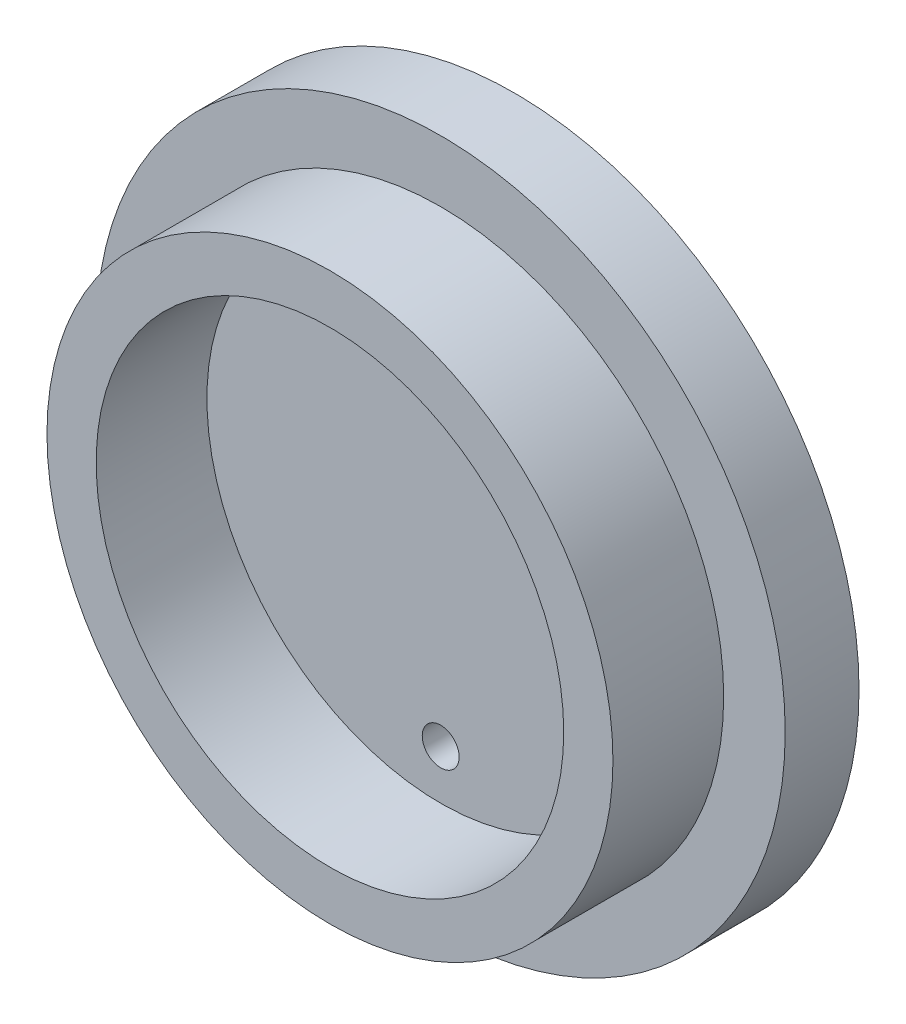
ISO-10303-21;
HEADER;
FILE_DESCRIPTION(('STEP AP214'),'2;1');
FILE_NAME('part.step','',(''),(''),'','','');
FILE_SCHEMA(('AUTOMOTIVE_DESIGN { 1 0 10303 214 1 1 1 1 }'));
ENDSEC;
DATA;
#1=APPLICATION_CONTEXT('core data for automotive mechanical design processes');
#2=APPLICATION_PROTOCOL_DEFINITION('international standard','automotive_design',2000,#1);
#3=PRODUCT_CONTEXT('',#1,'mechanical');
#4=PRODUCT('Part','Part','',(#3));
#5=PRODUCT_RELATED_PRODUCT_CATEGORY('part','',(#4));
#6=PRODUCT_DEFINITION_FORMATION('','',#4);
#7=PRODUCT_DEFINITION_CONTEXT('part definition',#1,'design');
#8=PRODUCT_DEFINITION('design','',#6,#7);
#9=PRODUCT_DEFINITION_SHAPE('','',#8);
#10=(LENGTH_UNIT() NAMED_UNIT(*) SI_UNIT(.MILLI.,.METRE.));
#11=(NAMED_UNIT(*) PLANE_ANGLE_UNIT() SI_UNIT($,.RADIAN.));
#12=(NAMED_UNIT(*) SI_UNIT($,.STERADIAN.) SOLID_ANGLE_UNIT());
#13=UNCERTAINTY_MEASURE_WITH_UNIT(LENGTH_MEASURE(1.E-05),#10,'distance_accuracy_value','');
#14=(GEOMETRIC_REPRESENTATION_CONTEXT(3) GLOBAL_UNCERTAINTY_ASSIGNED_CONTEXT((#13)) GLOBAL_UNIT_ASSIGNED_CONTEXT((#10,
#11,#12)) REPRESENTATION_CONTEXT('',''));
#15=CARTESIAN_POINT('',(0.,0.,0.));
#16=DIRECTION('',(0.,0.,1.));
#17=DIRECTION('',(1.,0.,0.));
#18=AXIS2_PLACEMENT_3D('',#15,#16,#17);
#19=CARTESIAN_POINT('',(0.,0.,6.));
#20=DIRECTION('',(0.,0.,-1.));
#21=DIRECTION('',(-1.,0.,0.));
#22=AXIS2_PLACEMENT_3D('',#19,#20,#21);
#23=CYLINDRICAL_SURFACE('',#22,28.);
#24=CARTESIAN_POINT('',(0.,0.,6.));
#25=DIRECTION('',(0.,0.,1.));
#26=DIRECTION('',(1.,0.,0.));
#27=AXIS2_PLACEMENT_3D('',#24,#25,#26);
#28=CIRCLE('',#27,28.);
#29=CARTESIAN_POINT('',(28.,0.,6.));
#30=VERTEX_POINT('',#29);
#31=EDGE_CURVE('E40',#30,#30,#28,.T.);
#32=ORIENTED_EDGE('',*,*,#31,.F.);
#33=EDGE_LOOP('',(#32));
#34=FACE_BOUND('',#33,.T.);
#35=CARTESIAN_POINT('',(0.,0.,0.));
#36=DIRECTION('',(0.,0.,1.));
#37=DIRECTION('',(1.,0.,0.));
#38=AXIS2_PLACEMENT_3D('',#35,#36,#37);
#39=CIRCLE('',#38,28.);
#40=CARTESIAN_POINT('',(28.,0.,0.));
#41=VERTEX_POINT('',#40);
#42=EDGE_CURVE('E45',#41,#41,#39,.T.);
#43=ORIENTED_EDGE('',*,*,#42,.T.);
#44=EDGE_LOOP('',(#43));
#45=FACE_BOUND('',#44,.T.);
#46=ADVANCED_FACE('F33',(#34,#45),#23,.T.);
#47=CARTESIAN_POINT('',(0.,0.,6.));
#48=DIRECTION('',(0.,0.,1.));
#49=DIRECTION('',(1.,0.,0.));
#50=AXIS2_PLACEMENT_3D('',#47,#48,#49);
#51=PLANE('',#50);
#52=CARTESIAN_POINT('',(0.,0.,6.));
#53=DIRECTION('',(0.,0.,1.));
#54=DIRECTION('',(1.,0.,0.));
#55=AXIS2_PLACEMENT_3D('',#52,#53,#54);
#56=CIRCLE('',#55,23.);
#57=CARTESIAN_POINT('',(23.,0.,6.));
#58=VERTEX_POINT('',#57);
#59=EDGE_CURVE('E48',#58,#58,#56,.F.);
#60=ORIENTED_EDGE('',*,*,#59,.T.);
#61=EDGE_LOOP('',(#60));
#62=FACE_BOUND('',#61,.T.);
#63=ORIENTED_EDGE('',*,*,#31,.T.);
#64=EDGE_LOOP('',(#63));
#65=FACE_BOUND('',#64,.T.);
#66=ADVANCED_FACE('F78',(#62,#65),#51,.T.);
#67=CARTESIAN_POINT('',(0.,0.,0.));
#68=DIRECTION('',(0.,0.,1.));
#69=DIRECTION('',(1.,0.,0.));
#70=AXIS2_PLACEMENT_3D('',#67,#68,#69);
#71=PLANE('',#70);
#72=CARTESIAN_POINT('',(0.,-15.,0.));
#73=DIRECTION('',(0.,0.,-1.));
#74=DIRECTION('',(-1.,0.,0.));
#75=AXIS2_PLACEMENT_3D('',#72,#73,#74);
#76=CIRCLE('',#75,1.5);
#77=CARTESIAN_POINT('',(-1.5,-15.,0.));
#78=VERTEX_POINT('',#77);
#79=EDGE_CURVE('E64',#78,#78,#76,.T.);
#80=ORIENTED_EDGE('',*,*,#79,.F.);
#81=EDGE_LOOP('',(#80));
#82=FACE_BOUND('',#81,.T.);
#83=ORIENTED_EDGE('',*,*,#42,.F.);
#84=EDGE_LOOP('',(#83));
#85=FACE_BOUND('',#84,.T.);
#86=ADVANCED_FACE('F89',(#82,#85),#71,.F.);
#87=CARTESIAN_POINT('',(0.,0.,15.));
#88=DIRECTION('',(0.,0.,-1.));
#89=DIRECTION('',(-1.,0.,0.));
#90=AXIS2_PLACEMENT_3D('',#87,#88,#89);
#91=CYLINDRICAL_SURFACE('',#90,19.);
#92=CARTESIAN_POINT('',(0.,0.,6.));
#93=DIRECTION('',(0.,0.,1.));
#94=DIRECTION('',(1.,0.,0.));
#95=AXIS2_PLACEMENT_3D('',#92,#93,#94);
#96=CIRCLE('',#95,19.);
#97=CARTESIAN_POINT('',(19.,0.,6.));
#98=VERTEX_POINT('',#97);
#99=EDGE_CURVE('E10',#98,#98,#96,.F.);
#100=ORIENTED_EDGE('',*,*,#99,.T.);
#101=EDGE_LOOP('',(#100));
#102=FACE_BOUND('',#101,.T.);
#103=CARTESIAN_POINT('',(0.,0.,15.));
#104=DIRECTION('',(0.,0.,1.));
#105=DIRECTION('',(1.,0.,0.));
#106=AXIS2_PLACEMENT_3D('',#103,#104,#105);
#107=CIRCLE('',#106,19.);
#108=CARTESIAN_POINT('',(19.,0.,15.));
#109=VERTEX_POINT('',#108);
#110=EDGE_CURVE('E58',#109,#109,#107,.T.);
#111=ORIENTED_EDGE('',*,*,#110,.T.);
#112=EDGE_LOOP('',(#111));
#113=FACE_BOUND('',#112,.T.);
#114=ADVANCED_FACE('F107',(#102,#113),#91,.F.);
#115=CARTESIAN_POINT('',(0.,0.,15.));
#116=DIRECTION('',(0.,0.,-1.));
#117=DIRECTION('',(-1.,0.,0.));
#118=AXIS2_PLACEMENT_3D('',#115,#116,#117);
#119=CYLINDRICAL_SURFACE('',#118,23.);
#120=ORIENTED_EDGE('',*,*,#59,.F.);
#121=EDGE_LOOP('',(#120));
#122=FACE_BOUND('',#121,.T.);
#123=CARTESIAN_POINT('',(0.,0.,15.));
#124=DIRECTION('',(0.,0.,1.));
#125=DIRECTION('',(1.,0.,0.));
#126=AXIS2_PLACEMENT_3D('',#123,#124,#125);
#127=CIRCLE('',#126,23.);
#128=CARTESIAN_POINT('',(23.,0.,15.));
#129=VERTEX_POINT('',#128);
#130=EDGE_CURVE('E54',#129,#129,#127,.T.);
#131=ORIENTED_EDGE('',*,*,#130,.F.);
#132=EDGE_LOOP('',(#131));
#133=FACE_BOUND('',#132,.T.);
#134=ADVANCED_FACE('F84',(#122,#133),#119,.T.);
#135=CARTESIAN_POINT('',(0.,0.,15.));
#136=DIRECTION('',(0.,0.,1.));
#137=DIRECTION('',(1.,0.,0.));
#138=AXIS2_PLACEMENT_3D('',#135,#136,#137);
#139=PLANE('',#138);
#140=ORIENTED_EDGE('',*,*,#110,.F.);
#141=EDGE_LOOP('',(#140));
#142=FACE_BOUND('',#141,.T.);
#143=ORIENTED_EDGE('',*,*,#130,.T.);
#144=EDGE_LOOP('',(#143));
#145=FACE_BOUND('',#144,.T.);
#146=ADVANCED_FACE('F76',(#142,#145),#139,.T.);
#147=CARTESIAN_POINT('',(0.,-15.,6.));
#148=DIRECTION('',(0.,0.,1.));
#149=DIRECTION('',(1.,0.,0.));
#150=AXIS2_PLACEMENT_3D('',#147,#148,#149);
#151=CIRCLE('',#150,1.5);
#152=CARTESIAN_POINT('',(1.5,-15.,6.));
#153=VERTEX_POINT('',#152);
#154=EDGE_CURVE('E36',#153,#153,#151,.T.);
#155=ORIENTED_EDGE('',*,*,#154,.F.);
#156=EDGE_LOOP('',(#155));
#157=FACE_BOUND('',#156,.T.);
#158=ORIENTED_EDGE('',*,*,#99,.F.);
#159=EDGE_LOOP('',(#158));
#160=FACE_BOUND('',#159,.T.);
#161=ADVANCED_FACE('F73',(#157,#160),#51,.T.);
#162=CARTESIAN_POINT('',(0.,-15.,15.));
#163=DIRECTION('',(0.,0.,-1.));
#164=DIRECTION('',(-1.,0.,0.));
#165=AXIS2_PLACEMENT_3D('',#162,#163,#164);
#166=CYLINDRICAL_SURFACE('',#165,1.5);
#167=ORIENTED_EDGE('',*,*,#154,.T.);
#168=EDGE_LOOP('',(#167));
#169=FACE_BOUND('',#168,.T.);
#170=ORIENTED_EDGE('',*,*,#79,.T.);
#171=EDGE_LOOP('',(#170));
#172=FACE_BOUND('',#171,.T.);
#173=ADVANCED_FACE('F71',(#169,#172),#166,.F.);
#174=CLOSED_SHELL('',(#46,#66,#86,#114,#134,#146,#161,#173));
#175=MANIFOLD_SOLID_BREP('B2',#174);
#176=ADVANCED_BREP_SHAPE_REPRESENTATION('',(#18,#175),#14);
#177=SHAPE_DEFINITION_REPRESENTATION(#9,#176);
ENDSEC;
END-ISO-10303-21;
